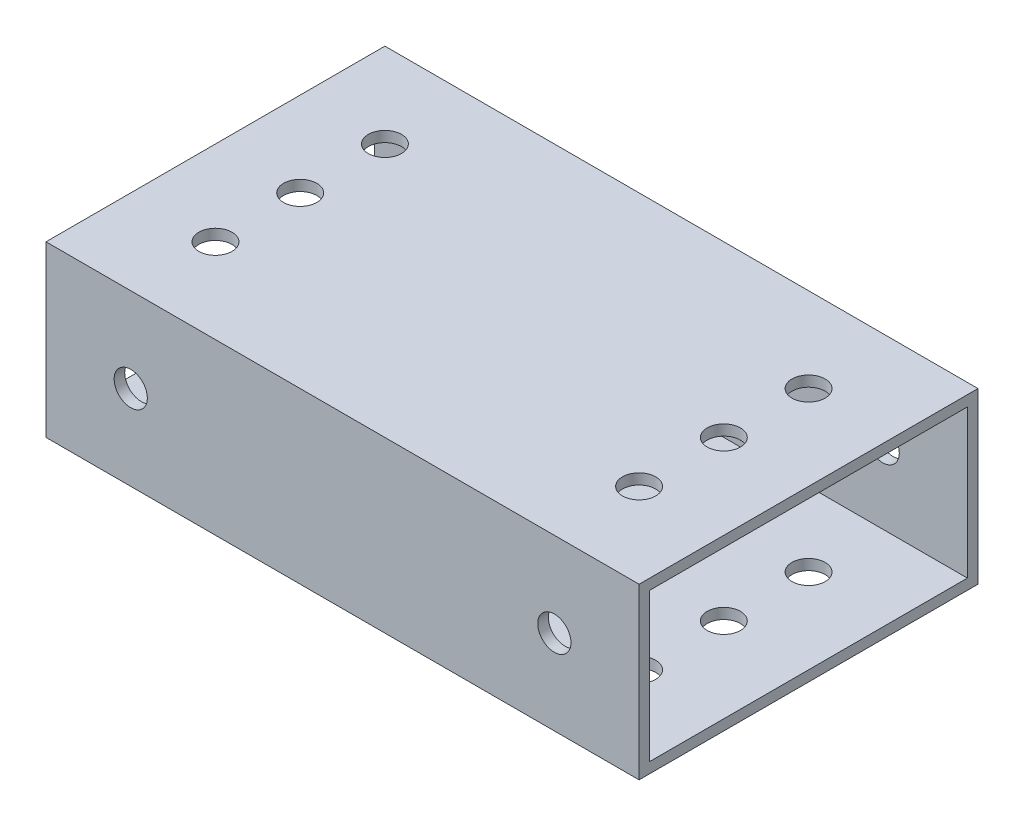
ISO-10303-21;
HEADER;
FILE_DESCRIPTION(('STEP AP214'),'2;1');
FILE_NAME('part.step','',(''),(''),'','','');
FILE_SCHEMA(('AUTOMOTIVE_DESIGN { 1 0 10303 214 1 1 1 1 }'));
ENDSEC;
DATA;
#1=APPLICATION_CONTEXT('core data for automotive mechanical design processes');
#2=APPLICATION_PROTOCOL_DEFINITION('international standard','automotive_design',2000,#1);
#3=PRODUCT_CONTEXT('',#1,'mechanical');
#4=PRODUCT('Part','Part','',(#3));
#5=PRODUCT_RELATED_PRODUCT_CATEGORY('part','',(#4));
#6=PRODUCT_DEFINITION_FORMATION('','',#4);
#7=PRODUCT_DEFINITION_CONTEXT('part definition',#1,'design');
#8=PRODUCT_DEFINITION('design','',#6,#7);
#9=PRODUCT_DEFINITION_SHAPE('','',#8);
#10=(LENGTH_UNIT() NAMED_UNIT(*) SI_UNIT(.MILLI.,.METRE.));
#11=(NAMED_UNIT(*) PLANE_ANGLE_UNIT() SI_UNIT($,.RADIAN.));
#12=(NAMED_UNIT(*) SI_UNIT($,.STERADIAN.) SOLID_ANGLE_UNIT());
#13=UNCERTAINTY_MEASURE_WITH_UNIT(LENGTH_MEASURE(1.E-05),#10,'distance_accuracy_value','');
#14=(GEOMETRIC_REPRESENTATION_CONTEXT(3) GLOBAL_UNCERTAINTY_ASSIGNED_CONTEXT((#13)) GLOBAL_UNIT_ASSIGNED_CONTEXT((#10,
#11,#12)) REPRESENTATION_CONTEXT('',''));
#15=CARTESIAN_POINT('',(0.,0.,0.));
#16=DIRECTION('',(0.,0.,1.));
#17=DIRECTION('',(1.,0.,0.));
#18=AXIS2_PLACEMENT_3D('',#15,#16,#17);
#19=CARTESIAN_POINT('',(44.45,0.,0.));
#20=DIRECTION('',(-1.,0.,0.));
#21=DIRECTION('',(0.,0.,1.));
#22=AXIS2_PLACEMENT_3D('',#19,#20,#21);
#23=PLANE('',#22);
#24=DIRECTION('',(0.,-1.,0.));
#25=VECTOR('',#24,1.);
#26=CARTESIAN_POINT('',(44.45,0.,0.));
#27=LINE('',#26,#25);
#28=CARTESIAN_POINT('',(44.45,25.4,0.));
#29=VERTEX_POINT('',#28);
#30=CARTESIAN_POINT('',(44.45,0.,0.));
#31=VERTEX_POINT('',#30);
#32=EDGE_CURVE('E135',#29,#31,#27,.T.);
#33=ORIENTED_EDGE('',*,*,#32,.T.);
#34=DIRECTION('',(0.,0.,-1.));
#35=VECTOR('',#34,1.);
#36=CARTESIAN_POINT('',(44.45,0.,0.));
#37=LINE('',#36,#35);
#38=CARTESIAN_POINT('',(44.45,0.,-50.8));
#39=VERTEX_POINT('',#38);
#40=EDGE_CURVE('E138',#31,#39,#37,.T.);
#41=ORIENTED_EDGE('',*,*,#40,.T.);
#42=DIRECTION('',(0.,1.,0.));
#43=VECTOR('',#42,1.);
#44=CARTESIAN_POINT('',(44.45,0.,-50.8));
#45=LINE('',#44,#43);
#46=CARTESIAN_POINT('',(44.45,25.4,-50.8));
#47=VERTEX_POINT('',#46);
#48=EDGE_CURVE('E141',#39,#47,#45,.T.);
#49=ORIENTED_EDGE('',*,*,#48,.T.);
#50=DIRECTION('',(0.,0.,1.));
#51=VECTOR('',#50,1.);
#52=CARTESIAN_POINT('',(44.45,25.4,0.));
#53=LINE('',#52,#51);
#54=EDGE_CURVE('E143',#47,#29,#53,.T.);
#55=ORIENTED_EDGE('',*,*,#54,.T.);
#56=EDGE_LOOP('',(#33,#41,#49,#55));
#57=FACE_BOUND('',#56,.T.);
#58=DIRECTION('',(0.,-1.,0.));
#59=VECTOR('',#58,1.);
#60=CARTESIAN_POINT('',(44.45,0.,-1.5875));
#61=LINE('',#60,#59);
#62=CARTESIAN_POINT('',(44.45,23.8125,-1.5875));
#63=VERTEX_POINT('',#62);
#64=CARTESIAN_POINT('',(44.45,1.5875,-1.5875));
#65=VERTEX_POINT('',#64);
#66=EDGE_CURVE('E123',#63,#65,#61,.T.);
#67=ORIENTED_EDGE('',*,*,#66,.F.);
#68=DIRECTION('',(0.,0.,1.));
#69=VECTOR('',#68,1.);
#70=CARTESIAN_POINT('',(44.45,23.8125,0.));
#71=LINE('',#70,#69);
#72=CARTESIAN_POINT('',(44.45,23.8125,-49.2125));
#73=VERTEX_POINT('',#72);
#74=EDGE_CURVE('E107',#73,#63,#71,.T.);
#75=ORIENTED_EDGE('',*,*,#74,.F.);
#76=DIRECTION('',(0.,1.,0.));
#77=VECTOR('',#76,1.);
#78=CARTESIAN_POINT('',(44.45,0.,-49.2125));
#79=LINE('',#78,#77);
#80=CARTESIAN_POINT('',(44.45,1.5875,-49.2125));
#81=VERTEX_POINT('',#80);
#82=EDGE_CURVE('E132',#81,#73,#79,.T.);
#83=ORIENTED_EDGE('',*,*,#82,.F.);
#84=DIRECTION('',(0.,0.,-1.));
#85=VECTOR('',#84,1.);
#86=CARTESIAN_POINT('',(44.45,1.5875,0.));
#87=LINE('',#86,#85);
#88=EDGE_CURVE('E125',#65,#81,#87,.T.);
#89=ORIENTED_EDGE('',*,*,#88,.F.);
#90=EDGE_LOOP('',(#67,#75,#83,#89));
#91=FACE_BOUND('',#90,.T.);
#92=ADVANCED_FACE('F35',(#57,#91),#23,.F.);
#93=CARTESIAN_POINT('',(-44.45,0.,0.));
#94=DIRECTION('',(-1.,0.,0.));
#95=DIRECTION('',(0.,0.,1.));
#96=AXIS2_PLACEMENT_3D('',#93,#94,#95);
#97=PLANE('',#96);
#98=DIRECTION('',(0.,-1.,0.));
#99=VECTOR('',#98,1.);
#100=CARTESIAN_POINT('',(-44.45,0.,0.));
#101=LINE('',#100,#99);
#102=CARTESIAN_POINT('',(-44.45,25.4,0.));
#103=VERTEX_POINT('',#102);
#104=CARTESIAN_POINT('',(-44.45,0.,0.));
#105=VERTEX_POINT('',#104);
#106=EDGE_CURVE('E146',#103,#105,#101,.T.);
#107=ORIENTED_EDGE('',*,*,#106,.F.);
#108=DIRECTION('',(0.,0.,1.));
#109=VECTOR('',#108,1.);
#110=CARTESIAN_POINT('',(-44.45,25.4,0.));
#111=LINE('',#110,#109);
#112=CARTESIAN_POINT('',(-44.45,25.4,-50.8));
#113=VERTEX_POINT('',#112);
#114=EDGE_CURVE('E139',#113,#103,#111,.T.);
#115=ORIENTED_EDGE('',*,*,#114,.F.);
#116=DIRECTION('',(0.,1.,0.));
#117=VECTOR('',#116,1.);
#118=CARTESIAN_POINT('',(-44.45,0.,-50.8));
#119=LINE('',#118,#117);
#120=CARTESIAN_POINT('',(-44.45,0.,-50.8));
#121=VERTEX_POINT('',#120);
#122=EDGE_CURVE('E151',#121,#113,#119,.T.);
#123=ORIENTED_EDGE('',*,*,#122,.F.);
#124=DIRECTION('',(0.,0.,-1.));
#125=VECTOR('',#124,1.);
#126=CARTESIAN_POINT('',(-44.45,0.,0.));
#127=LINE('',#126,#125);
#128=EDGE_CURVE('E149',#105,#121,#127,.T.);
#129=ORIENTED_EDGE('',*,*,#128,.F.);
#130=EDGE_LOOP('',(#107,#115,#123,#129));
#131=FACE_BOUND('',#130,.T.);
#132=DIRECTION('',(0.,0.,1.));
#133=VECTOR('',#132,1.);
#134=CARTESIAN_POINT('',(-44.45,23.8125,0.));
#135=LINE('',#134,#133);
#136=CARTESIAN_POINT('',(-44.45,23.8125,-49.2125));
#137=VERTEX_POINT('',#136);
#138=CARTESIAN_POINT('',(-44.45,23.8125,-1.5875));
#139=VERTEX_POINT('',#138);
#140=EDGE_CURVE('E105',#137,#139,#135,.T.);
#141=ORIENTED_EDGE('',*,*,#140,.T.);
#142=DIRECTION('',(0.,-1.,0.));
#143=VECTOR('',#142,1.);
#144=CARTESIAN_POINT('',(-44.45,0.,-1.5875));
#145=LINE('',#144,#143);
#146=CARTESIAN_POINT('',(-44.45,1.5875,-1.5875));
#147=VERTEX_POINT('',#146);
#148=EDGE_CURVE('E113',#139,#147,#145,.T.);
#149=ORIENTED_EDGE('',*,*,#148,.T.);
#150=DIRECTION('',(0.,0.,-1.));
#151=VECTOR('',#150,1.);
#152=CARTESIAN_POINT('',(-44.45,1.5875,0.));
#153=LINE('',#152,#151);
#154=CARTESIAN_POINT('',(-44.45,1.5875,-49.2125));
#155=VERTEX_POINT('',#154);
#156=EDGE_CURVE('E119',#147,#155,#153,.T.);
#157=ORIENTED_EDGE('',*,*,#156,.T.);
#158=DIRECTION('',(0.,1.,0.));
#159=VECTOR('',#158,1.);
#160=CARTESIAN_POINT('',(-44.45,0.,-49.2125));
#161=LINE('',#160,#159);
#162=EDGE_CURVE('E59',#155,#137,#161,.T.);
#163=ORIENTED_EDGE('',*,*,#162,.T.);
#164=EDGE_LOOP('',(#141,#149,#157,#163));
#165=FACE_BOUND('',#164,.T.);
#166=ADVANCED_FACE('F122',(#131,#165),#97,.T.);
#167=CARTESIAN_POINT('',(44.45,0.,0.));
#168=DIRECTION('',(0.,0.,-1.));
#169=DIRECTION('',(-1.,0.,0.));
#170=AXIS2_PLACEMENT_3D('',#167,#168,#169);
#171=PLANE('',#170);
#172=CARTESIAN_POINT('',(31.75,12.7,0.));
#173=DIRECTION('',(0.,0.,-1.));
#174=DIRECTION('',(-1.,0.,0.));
#175=AXIS2_PLACEMENT_3D('',#172,#173,#174);
#176=CIRCLE('',#175,2.4892);
#177=CARTESIAN_POINT('',(29.2608,12.7,0.));
#178=VERTEX_POINT('',#177);
#179=EDGE_CURVE('E374',#178,#178,#176,.T.);
#180=ORIENTED_EDGE('',*,*,#179,.T.);
#181=EDGE_LOOP('',(#180));
#182=FACE_BOUND('',#181,.T.);
#183=CARTESIAN_POINT('',(-31.75,12.7,0.));
#184=DIRECTION('',(0.,0.,1.));
#185=DIRECTION('',(1.,0.,0.));
#186=AXIS2_PLACEMENT_3D('',#183,#184,#185);
#187=CIRCLE('',#186,2.4892);
#188=CARTESIAN_POINT('',(-29.2608,12.7,0.));
#189=VERTEX_POINT('',#188);
#190=EDGE_CURVE('E192',#189,#189,#187,.T.);
#191=ORIENTED_EDGE('',*,*,#190,.F.);
#192=EDGE_LOOP('',(#191));
#193=FACE_BOUND('',#192,.T.);
#194=ORIENTED_EDGE('',*,*,#106,.T.);
#195=DIRECTION('',(-1.,0.,0.));
#196=VECTOR('',#195,1.);
#197=CARTESIAN_POINT('',(44.45,0.,0.));
#198=LINE('',#197,#196);
#199=EDGE_CURVE('E11',#31,#105,#198,.T.);
#200=ORIENTED_EDGE('',*,*,#199,.F.);
#201=ORIENTED_EDGE('',*,*,#32,.F.);
#202=DIRECTION('',(-1.,0.,0.));
#203=VECTOR('',#202,1.);
#204=CARTESIAN_POINT('',(44.45,25.4,0.));
#205=LINE('',#204,#203);
#206=EDGE_CURVE('E145',#29,#103,#205,.T.);
#207=ORIENTED_EDGE('',*,*,#206,.T.);
#208=EDGE_LOOP('',(#194,#200,#201,#207));
#209=FACE_BOUND('',#208,.T.);
#210=ADVANCED_FACE('F37',(#182,#193,#209),#171,.F.);
#211=CARTESIAN_POINT('',(44.45,0.,0.));
#212=DIRECTION('',(0.,1.,0.));
#213=DIRECTION('',(0.,0.,1.));
#214=AXIS2_PLACEMENT_3D('',#211,#212,#213);
#215=PLANE('',#214);
#216=CARTESIAN_POINT('',(31.75,0.,-38.1));
#217=DIRECTION('',(0.,-1.,0.));
#218=DIRECTION('',(0.,0.,1.));
#219=AXIS2_PLACEMENT_3D('',#216,#217,#218);
#220=CIRCLE('',#219,2.4892);
#221=CARTESIAN_POINT('',(31.75,0.,-35.6108));
#222=VERTEX_POINT('',#221);
#223=EDGE_CURVE('E276',#222,#222,#220,.T.);
#224=ORIENTED_EDGE('',*,*,#223,.F.);
#225=EDGE_LOOP('',(#224));
#226=FACE_BOUND('',#225,.T.);
#227=CARTESIAN_POINT('',(31.75,0.,-12.7));
#228=DIRECTION('',(0.,-1.,0.));
#229=DIRECTION('',(0.,0.,1.));
#230=AXIS2_PLACEMENT_3D('',#227,#228,#229);
#231=CIRCLE('',#230,2.4892);
#232=CARTESIAN_POINT('',(31.75,0.,-10.2108));
#233=VERTEX_POINT('',#232);
#234=EDGE_CURVE('E280',#233,#233,#231,.T.);
#235=ORIENTED_EDGE('',*,*,#234,.F.);
#236=EDGE_LOOP('',(#235));
#237=FACE_BOUND('',#236,.T.);
#238=CARTESIAN_POINT('',(31.75,0.,-25.4));
#239=DIRECTION('',(0.,-1.,0.));
#240=DIRECTION('',(0.,0.,1.));
#241=AXIS2_PLACEMENT_3D('',#238,#239,#240);
#242=CIRCLE('',#241,2.4892);
#243=CARTESIAN_POINT('',(31.75,0.,-22.9108));
#244=VERTEX_POINT('',#243);
#245=EDGE_CURVE('E182',#244,#244,#242,.T.);
#246=ORIENTED_EDGE('',*,*,#245,.F.);
#247=EDGE_LOOP('',(#246));
#248=FACE_BOUND('',#247,.T.);
#249=CARTESIAN_POINT('',(-31.75,0.,-38.1));
#250=DIRECTION('',(0.,1.,0.));
#251=DIRECTION('',(0.,0.,1.));
#252=AXIS2_PLACEMENT_3D('',#249,#250,#251);
#253=CIRCLE('',#252,2.4892);
#254=CARTESIAN_POINT('',(-31.75,0.,-35.6108));
#255=VERTEX_POINT('',#254);
#256=EDGE_CURVE('E215',#255,#255,#253,.T.);
#257=ORIENTED_EDGE('',*,*,#256,.T.);
#258=EDGE_LOOP('',(#257));
#259=FACE_BOUND('',#258,.T.);
#260=CARTESIAN_POINT('',(-31.75,0.,-12.7));
#261=DIRECTION('',(0.,1.,0.));
#262=DIRECTION('',(0.,0.,1.));
#263=AXIS2_PLACEMENT_3D('',#260,#261,#262);
#264=CIRCLE('',#263,2.4892);
#265=CARTESIAN_POINT('',(-31.75,0.,-10.2108));
#266=VERTEX_POINT('',#265);
#267=EDGE_CURVE('E208',#266,#266,#264,.T.);
#268=ORIENTED_EDGE('',*,*,#267,.T.);
#269=EDGE_LOOP('',(#268));
#270=FACE_BOUND('',#269,.T.);
#271=CARTESIAN_POINT('',(-31.75,0.,-25.4));
#272=DIRECTION('',(0.,1.,0.));
#273=DIRECTION('',(0.,0.,1.));
#274=AXIS2_PLACEMENT_3D('',#271,#272,#273);
#275=CIRCLE('',#274,2.4892);
#276=CARTESIAN_POINT('',(-31.75,0.,-22.9108));
#277=VERTEX_POINT('',#276);
#278=EDGE_CURVE('E165',#277,#277,#275,.T.);
#279=ORIENTED_EDGE('',*,*,#278,.T.);
#280=EDGE_LOOP('',(#279));
#281=FACE_BOUND('',#280,.T.);
#282=ORIENTED_EDGE('',*,*,#128,.T.);
#283=DIRECTION('',(-1.,0.,0.));
#284=VECTOR('',#283,1.);
#285=CARTESIAN_POINT('',(44.45,0.,-50.8));
#286=LINE('',#285,#284);
#287=EDGE_CURVE('E44',#39,#121,#286,.T.);
#288=ORIENTED_EDGE('',*,*,#287,.F.);
#289=ORIENTED_EDGE('',*,*,#40,.F.);
#290=ORIENTED_EDGE('',*,*,#199,.T.);
#291=EDGE_LOOP('',(#282,#288,#289,#290));
#292=FACE_BOUND('',#291,.T.);
#293=ADVANCED_FACE('F265',(#226,#237,#248,#259,#270,#281,#292),#215,.F.);
#294=CARTESIAN_POINT('',(44.45,0.,-50.8));
#295=DIRECTION('',(0.,0.,1.));
#296=DIRECTION('',(1.,0.,0.));
#297=AXIS2_PLACEMENT_3D('',#294,#295,#296);
#298=PLANE('',#297);
#299=CARTESIAN_POINT('',(31.75,12.7,-50.8));
#300=DIRECTION('',(0.,0.,-1.));
#301=DIRECTION('',(-1.,0.,0.));
#302=AXIS2_PLACEMENT_3D('',#299,#300,#301);
#303=CIRCLE('',#302,2.4892);
#304=CARTESIAN_POINT('',(29.2608,12.7,-50.8));
#305=VERTEX_POINT('',#304);
#306=EDGE_CURVE('E377',#305,#305,#303,.T.);
#307=ORIENTED_EDGE('',*,*,#306,.F.);
#308=EDGE_LOOP('',(#307));
#309=FACE_BOUND('',#308,.T.);
#310=CARTESIAN_POINT('',(-31.75,12.7,-50.8));
#311=DIRECTION('',(0.,0.,1.));
#312=DIRECTION('',(1.,0.,0.));
#313=AXIS2_PLACEMENT_3D('',#310,#311,#312);
#314=CIRCLE('',#313,2.4892);
#315=CARTESIAN_POINT('',(-29.2608,12.7,-50.8));
#316=VERTEX_POINT('',#315);
#317=EDGE_CURVE('E177',#316,#316,#314,.T.);
#318=ORIENTED_EDGE('',*,*,#317,.T.);
#319=EDGE_LOOP('',(#318));
#320=FACE_BOUND('',#319,.T.);
#321=ORIENTED_EDGE('',*,*,#122,.T.);
#322=DIRECTION('',(-1.,0.,0.));
#323=VECTOR('',#322,1.);
#324=CARTESIAN_POINT('',(44.45,25.4,-50.8));
#325=LINE('',#324,#323);
#326=EDGE_CURVE('E156',#47,#113,#325,.T.);
#327=ORIENTED_EDGE('',*,*,#326,.F.);
#328=ORIENTED_EDGE('',*,*,#48,.F.);
#329=ORIENTED_EDGE('',*,*,#287,.T.);
#330=EDGE_LOOP('',(#321,#327,#328,#329));
#331=FACE_BOUND('',#330,.T.);
#332=ADVANCED_FACE('F262',(#309,#320,#331),#298,.F.);
#333=CARTESIAN_POINT('',(44.45,25.4,0.));
#334=DIRECTION('',(0.,-1.,0.));
#335=DIRECTION('',(0.,0.,-1.));
#336=AXIS2_PLACEMENT_3D('',#333,#334,#335);
#337=PLANE('',#336);
#338=CARTESIAN_POINT('',(31.75,25.4,-38.1));
#339=DIRECTION('',(0.,-1.,0.));
#340=DIRECTION('',(0.,0.,1.));
#341=AXIS2_PLACEMENT_3D('',#338,#339,#340);
#342=CIRCLE('',#341,2.4892);
#343=CARTESIAN_POINT('',(31.75,25.4,-35.6108));
#344=VERTEX_POINT('',#343);
#345=EDGE_CURVE('E365',#344,#344,#342,.T.);
#346=ORIENTED_EDGE('',*,*,#345,.T.);
#347=EDGE_LOOP('',(#346));
#348=FACE_BOUND('',#347,.T.);
#349=CARTESIAN_POINT('',(31.75,25.4,-12.7));
#350=DIRECTION('',(0.,-1.,0.));
#351=DIRECTION('',(0.,0.,1.));
#352=AXIS2_PLACEMENT_3D('',#349,#350,#351);
#353=CIRCLE('',#352,2.4892);
#354=CARTESIAN_POINT('',(31.75,25.4,-10.2108));
#355=VERTEX_POINT('',#354);
#356=EDGE_CURVE('E362',#355,#355,#353,.T.);
#357=ORIENTED_EDGE('',*,*,#356,.T.);
#358=EDGE_LOOP('',(#357));
#359=FACE_BOUND('',#358,.T.);
#360=CARTESIAN_POINT('',(31.75,25.4,-25.4));
#361=DIRECTION('',(0.,-1.,0.));
#362=DIRECTION('',(0.,0.,1.));
#363=AXIS2_PLACEMENT_3D('',#360,#361,#362);
#364=CIRCLE('',#363,2.4892);
#365=CARTESIAN_POINT('',(31.75,25.4,-22.9108));
#366=VERTEX_POINT('',#365);
#367=EDGE_CURVE('E359',#366,#366,#364,.T.);
#368=ORIENTED_EDGE('',*,*,#367,.T.);
#369=EDGE_LOOP('',(#368));
#370=FACE_BOUND('',#369,.T.);
#371=CARTESIAN_POINT('',(-31.75,25.4,-38.1));
#372=DIRECTION('',(0.,1.,0.));
#373=DIRECTION('',(0.,0.,1.));
#374=AXIS2_PLACEMENT_3D('',#371,#372,#373);
#375=CIRCLE('',#374,2.4892);
#376=CARTESIAN_POINT('',(-31.75,25.4,-35.6108));
#377=VERTEX_POINT('',#376);
#378=EDGE_CURVE('E207',#377,#377,#375,.T.);
#379=ORIENTED_EDGE('',*,*,#378,.F.);
#380=EDGE_LOOP('',(#379));
#381=FACE_BOUND('',#380,.T.);
#382=CARTESIAN_POINT('',(-31.75,25.4,-12.7));
#383=DIRECTION('',(0.,1.,0.));
#384=DIRECTION('',(0.,0.,1.));
#385=AXIS2_PLACEMENT_3D('',#382,#383,#384);
#386=CIRCLE('',#385,2.4892);
#387=CARTESIAN_POINT('',(-31.75,25.4,-10.2108));
#388=VERTEX_POINT('',#387);
#389=EDGE_CURVE('E212',#388,#388,#386,.T.);
#390=ORIENTED_EDGE('',*,*,#389,.F.);
#391=EDGE_LOOP('',(#390));
#392=FACE_BOUND('',#391,.T.);
#393=CARTESIAN_POINT('',(-31.75,25.4,-25.4));
#394=DIRECTION('',(0.,1.,0.));
#395=DIRECTION('',(0.,0.,1.));
#396=AXIS2_PLACEMENT_3D('',#393,#394,#395);
#397=CIRCLE('',#396,2.4892);
#398=CARTESIAN_POINT('',(-31.75,25.4,-22.9108));
#399=VERTEX_POINT('',#398);
#400=EDGE_CURVE('E211',#399,#399,#397,.T.);
#401=ORIENTED_EDGE('',*,*,#400,.F.);
#402=EDGE_LOOP('',(#401));
#403=FACE_BOUND('',#402,.T.);
#404=ORIENTED_EDGE('',*,*,#114,.T.);
#405=ORIENTED_EDGE('',*,*,#206,.F.);
#406=ORIENTED_EDGE('',*,*,#54,.F.);
#407=ORIENTED_EDGE('',*,*,#326,.T.);
#408=EDGE_LOOP('',(#404,#405,#406,#407));
#409=FACE_BOUND('',#408,.T.);
#410=ADVANCED_FACE('F247',(#348,#359,#370,#381,#392,#403,#409),#337,.F.);
#411=CARTESIAN_POINT('',(44.45,0.,-1.5875));
#412=DIRECTION('',(0.,0.,-1.));
#413=DIRECTION('',(-1.,0.,0.));
#414=AXIS2_PLACEMENT_3D('',#411,#412,#413);
#415=PLANE('',#414);
#416=CARTESIAN_POINT('',(31.75,12.7,-1.5875));
#417=DIRECTION('',(0.,0.,-1.));
#418=DIRECTION('',(-1.,0.,0.));
#419=AXIS2_PLACEMENT_3D('',#416,#417,#418);
#420=CIRCLE('',#419,2.4892);
#421=CARTESIAN_POINT('',(29.2608,12.7,-1.5875));
#422=VERTEX_POINT('',#421);
#423=EDGE_CURVE('E368',#422,#422,#420,.F.);
#424=ORIENTED_EDGE('',*,*,#423,.T.);
#425=EDGE_LOOP('',(#424));
#426=FACE_BOUND('',#425,.T.);
#427=CARTESIAN_POINT('',(-31.75,12.7,-1.5875));
#428=DIRECTION('',(0.,0.,-1.));
#429=DIRECTION('',(-1.,0.,0.));
#430=AXIS2_PLACEMENT_3D('',#427,#428,#429);
#431=CIRCLE('',#430,2.4892);
#432=CARTESIAN_POINT('',(-34.2392,12.7,-1.5875));
#433=VERTEX_POINT('',#432);
#434=EDGE_CURVE('E176',#433,#433,#431,.T.);
#435=ORIENTED_EDGE('',*,*,#434,.F.);
#436=EDGE_LOOP('',(#435));
#437=FACE_BOUND('',#436,.T.);
#438=ORIENTED_EDGE('',*,*,#148,.F.);
#439=DIRECTION('',(-1.,0.,0.));
#440=VECTOR('',#439,1.);
#441=CARTESIAN_POINT('',(44.45,23.8125,-1.5875));
#442=LINE('',#441,#440);
#443=EDGE_CURVE('E101',#63,#139,#442,.T.);
#444=ORIENTED_EDGE('',*,*,#443,.F.);
#445=ORIENTED_EDGE('',*,*,#66,.T.);
#446=DIRECTION('',(-1.,0.,0.));
#447=VECTOR('',#446,1.);
#448=CARTESIAN_POINT('',(44.45,1.5875,-1.5875));
#449=LINE('',#448,#447);
#450=EDGE_CURVE('E116',#65,#147,#449,.T.);
#451=ORIENTED_EDGE('',*,*,#450,.T.);
#452=EDGE_LOOP('',(#438,#444,#445,#451));
#453=FACE_BOUND('',#452,.T.);
#454=ADVANCED_FACE('F114',(#426,#437,#453),#415,.T.);
#455=CARTESIAN_POINT('',(44.45,1.5875,0.));
#456=DIRECTION('',(0.,1.,0.));
#457=DIRECTION('',(0.,0.,1.));
#458=AXIS2_PLACEMENT_3D('',#455,#456,#457);
#459=PLANE('',#458);
#460=CARTESIAN_POINT('',(31.75,1.5875,-38.1));
#461=DIRECTION('',(0.,1.,0.));
#462=DIRECTION('',(0.,0.,1.));
#463=AXIS2_PLACEMENT_3D('',#460,#461,#462);
#464=CIRCLE('',#463,2.4892);
#465=CARTESIAN_POINT('',(31.75,1.5875,-35.6108));
#466=VERTEX_POINT('',#465);
#467=EDGE_CURVE('E188',#466,#466,#464,.F.);
#468=ORIENTED_EDGE('',*,*,#467,.T.);
#469=EDGE_LOOP('',(#468));
#470=FACE_BOUND('',#469,.T.);
#471=CARTESIAN_POINT('',(31.75,1.5875,-12.7));
#472=DIRECTION('',(0.,1.,0.));
#473=DIRECTION('',(0.,0.,1.));
#474=AXIS2_PLACEMENT_3D('',#471,#472,#473);
#475=CIRCLE('',#474,2.4892);
#476=CARTESIAN_POINT('',(31.75,1.5875,-10.2108));
#477=VERTEX_POINT('',#476);
#478=EDGE_CURVE('E185',#477,#477,#475,.F.);
#479=ORIENTED_EDGE('',*,*,#478,.T.);
#480=EDGE_LOOP('',(#479));
#481=FACE_BOUND('',#480,.T.);
#482=CARTESIAN_POINT('',(31.75,1.5875,-25.4));
#483=DIRECTION('',(0.,1.,0.));
#484=DIRECTION('',(0.,0.,1.));
#485=AXIS2_PLACEMENT_3D('',#482,#483,#484);
#486=CIRCLE('',#485,2.4892);
#487=CARTESIAN_POINT('',(31.75,1.5875,-22.9108));
#488=VERTEX_POINT('',#487);
#489=EDGE_CURVE('E181',#488,#488,#486,.F.);
#490=ORIENTED_EDGE('',*,*,#489,.T.);
#491=EDGE_LOOP('',(#490));
#492=FACE_BOUND('',#491,.T.);
#493=CARTESIAN_POINT('',(-31.75,1.5875,-38.1));
#494=DIRECTION('',(0.,1.,0.));
#495=DIRECTION('',(0.,0.,1.));
#496=AXIS2_PLACEMENT_3D('',#493,#494,#495);
#497=CIRCLE('',#496,2.4892);
#498=CARTESIAN_POINT('',(-31.75,1.5875,-35.6108));
#499=VERTEX_POINT('',#498);
#500=EDGE_CURVE('E120',#499,#499,#497,.T.);
#501=ORIENTED_EDGE('',*,*,#500,.F.);
#502=EDGE_LOOP('',(#501));
#503=FACE_BOUND('',#502,.T.);
#504=CARTESIAN_POINT('',(-31.75,1.5875,-12.7));
#505=DIRECTION('',(0.,1.,0.));
#506=DIRECTION('',(0.,0.,1.));
#507=AXIS2_PLACEMENT_3D('',#504,#505,#506);
#508=CIRCLE('',#507,2.4892);
#509=CARTESIAN_POINT('',(-31.75,1.5875,-10.2108));
#510=VERTEX_POINT('',#509);
#511=EDGE_CURVE('E169',#510,#510,#508,.T.);
#512=ORIENTED_EDGE('',*,*,#511,.F.);
#513=EDGE_LOOP('',(#512));
#514=FACE_BOUND('',#513,.T.);
#515=CARTESIAN_POINT('',(-31.75,1.5875,-25.4));
#516=DIRECTION('',(0.,1.,0.));
#517=DIRECTION('',(0.,0.,1.));
#518=AXIS2_PLACEMENT_3D('',#515,#516,#517);
#519=CIRCLE('',#518,2.4892);
#520=CARTESIAN_POINT('',(-31.75,1.5875,-22.9108));
#521=VERTEX_POINT('',#520);
#522=EDGE_CURVE('E164',#521,#521,#519,.T.);
#523=ORIENTED_EDGE('',*,*,#522,.F.);
#524=EDGE_LOOP('',(#523));
#525=FACE_BOUND('',#524,.T.);
#526=ORIENTED_EDGE('',*,*,#156,.F.);
#527=ORIENTED_EDGE('',*,*,#450,.F.);
#528=ORIENTED_EDGE('',*,*,#88,.T.);
#529=DIRECTION('',(-1.,0.,0.));
#530=VECTOR('',#529,1.);
#531=CARTESIAN_POINT('',(44.45,1.5875,-49.2125));
#532=LINE('',#531,#530);
#533=EDGE_CURVE('E230',#81,#155,#532,.T.);
#534=ORIENTED_EDGE('',*,*,#533,.T.);
#535=EDGE_LOOP('',(#526,#527,#528,#534));
#536=FACE_BOUND('',#535,.T.);
#537=ADVANCED_FACE('F237',(#470,#481,#492,#503,#514,#525,#536),#459,.T.);
#538=CARTESIAN_POINT('',(44.45,0.,-49.2125));
#539=DIRECTION('',(0.,0.,1.));
#540=DIRECTION('',(1.,0.,0.));
#541=AXIS2_PLACEMENT_3D('',#538,#539,#540);
#542=PLANE('',#541);
#543=CARTESIAN_POINT('',(31.75,12.7,-49.2125));
#544=DIRECTION('',(0.,0.,1.));
#545=DIRECTION('',(1.,0.,0.));
#546=AXIS2_PLACEMENT_3D('',#543,#544,#545);
#547=CIRCLE('',#546,2.4892);
#548=CARTESIAN_POINT('',(34.2392,12.7,-49.2125));
#549=VERTEX_POINT('',#548);
#550=EDGE_CURVE('E39',#549,#549,#547,.F.);
#551=ORIENTED_EDGE('',*,*,#550,.T.);
#552=EDGE_LOOP('',(#551));
#553=FACE_BOUND('',#552,.T.);
#554=CARTESIAN_POINT('',(-31.75,12.7,-49.2125));
#555=DIRECTION('',(0.,0.,1.));
#556=DIRECTION('',(1.,0.,0.));
#557=AXIS2_PLACEMENT_3D('',#554,#555,#556);
#558=CIRCLE('',#557,2.4892);
#559=CARTESIAN_POINT('',(-29.2608,12.7,-49.2125));
#560=VERTEX_POINT('',#559);
#561=EDGE_CURVE('E173',#560,#560,#558,.T.);
#562=ORIENTED_EDGE('',*,*,#561,.F.);
#563=EDGE_LOOP('',(#562));
#564=FACE_BOUND('',#563,.T.);
#565=ORIENTED_EDGE('',*,*,#162,.F.);
#566=ORIENTED_EDGE('',*,*,#533,.F.);
#567=ORIENTED_EDGE('',*,*,#82,.T.);
#568=DIRECTION('',(-1.,0.,0.));
#569=VECTOR('',#568,1.);
#570=CARTESIAN_POINT('',(44.45,23.8125,-49.2125));
#571=LINE('',#570,#569);
#572=EDGE_CURVE('E52',#73,#137,#571,.T.);
#573=ORIENTED_EDGE('',*,*,#572,.T.);
#574=EDGE_LOOP('',(#565,#566,#567,#573));
#575=FACE_BOUND('',#574,.T.);
#576=ADVANCED_FACE('F232',(#553,#564,#575),#542,.T.);
#577=CARTESIAN_POINT('',(44.45,23.8125,0.));
#578=DIRECTION('',(0.,-1.,0.));
#579=DIRECTION('',(0.,0.,-1.));
#580=AXIS2_PLACEMENT_3D('',#577,#578,#579);
#581=PLANE('',#580);
#582=CARTESIAN_POINT('',(31.75,23.8125,-38.1));
#583=DIRECTION('',(0.,-1.,0.));
#584=DIRECTION('',(0.,0.,-1.));
#585=AXIS2_PLACEMENT_3D('',#582,#583,#584);
#586=CIRCLE('',#585,2.4892);
#587=CARTESIAN_POINT('',(31.75,23.8125,-40.5892));
#588=VERTEX_POINT('',#587);
#589=EDGE_CURVE('E186',#588,#588,#586,.F.);
#590=ORIENTED_EDGE('',*,*,#589,.T.);
#591=EDGE_LOOP('',(#590));
#592=FACE_BOUND('',#591,.T.);
#593=CARTESIAN_POINT('',(31.75,23.8125,-12.7));
#594=DIRECTION('',(0.,-1.,0.));
#595=DIRECTION('',(0.,0.,-1.));
#596=AXIS2_PLACEMENT_3D('',#593,#594,#595);
#597=CIRCLE('',#596,2.4892);
#598=CARTESIAN_POINT('',(31.75,23.8125,-15.1892));
#599=VERTEX_POINT('',#598);
#600=EDGE_CURVE('E183',#599,#599,#597,.F.);
#601=ORIENTED_EDGE('',*,*,#600,.T.);
#602=EDGE_LOOP('',(#601));
#603=FACE_BOUND('',#602,.T.);
#604=CARTESIAN_POINT('',(31.75,23.8125,-25.4));
#605=DIRECTION('',(0.,-1.,0.));
#606=DIRECTION('',(0.,0.,-1.));
#607=AXIS2_PLACEMENT_3D('',#604,#605,#606);
#608=CIRCLE('',#607,2.4892);
#609=CARTESIAN_POINT('',(31.75,23.8125,-27.8892));
#610=VERTEX_POINT('',#609);
#611=EDGE_CURVE('E178',#610,#610,#608,.F.);
#612=ORIENTED_EDGE('',*,*,#611,.T.);
#613=EDGE_LOOP('',(#612));
#614=FACE_BOUND('',#613,.T.);
#615=CARTESIAN_POINT('',(-31.75,23.8125,-38.1));
#616=DIRECTION('',(0.,-1.,0.));
#617=DIRECTION('',(0.,0.,-1.));
#618=AXIS2_PLACEMENT_3D('',#615,#616,#617);
#619=CIRCLE('',#618,2.4892);
#620=CARTESIAN_POINT('',(-31.75,23.8125,-40.5892));
#621=VERTEX_POINT('',#620);
#622=EDGE_CURVE('E170',#621,#621,#619,.T.);
#623=ORIENTED_EDGE('',*,*,#622,.F.);
#624=EDGE_LOOP('',(#623));
#625=FACE_BOUND('',#624,.T.);
#626=CARTESIAN_POINT('',(-31.75,23.8125,-12.7));
#627=DIRECTION('',(0.,-1.,0.));
#628=DIRECTION('',(0.,0.,-1.));
#629=AXIS2_PLACEMENT_3D('',#626,#627,#628);
#630=CIRCLE('',#629,2.4892);
#631=CARTESIAN_POINT('',(-31.75,23.8125,-15.1892));
#632=VERTEX_POINT('',#631);
#633=EDGE_CURVE('E166',#632,#632,#630,.T.);
#634=ORIENTED_EDGE('',*,*,#633,.F.);
#635=EDGE_LOOP('',(#634));
#636=FACE_BOUND('',#635,.T.);
#637=CARTESIAN_POINT('',(-31.75,23.8125,-25.4));
#638=DIRECTION('',(0.,-1.,0.));
#639=DIRECTION('',(0.,0.,-1.));
#640=AXIS2_PLACEMENT_3D('',#637,#638,#639);
#641=CIRCLE('',#640,2.4892);
#642=CARTESIAN_POINT('',(-31.75,23.8125,-27.8892));
#643=VERTEX_POINT('',#642);
#644=EDGE_CURVE('E161',#643,#643,#641,.T.);
#645=ORIENTED_EDGE('',*,*,#644,.F.);
#646=EDGE_LOOP('',(#645));
#647=FACE_BOUND('',#646,.T.);
#648=ORIENTED_EDGE('',*,*,#140,.F.);
#649=ORIENTED_EDGE('',*,*,#572,.F.);
#650=ORIENTED_EDGE('',*,*,#74,.T.);
#651=ORIENTED_EDGE('',*,*,#443,.T.);
#652=EDGE_LOOP('',(#648,#649,#650,#651));
#653=FACE_BOUND('',#652,.T.);
#654=ADVANCED_FACE('F103',(#592,#603,#614,#625,#636,#647,#653),#581,.T.);
#655=CARTESIAN_POINT('',(-31.75,0.,-25.4));
#656=DIRECTION('',(0.,1.,0.));
#657=DIRECTION('',(0.,0.,1.));
#658=AXIS2_PLACEMENT_3D('',#655,#656,#657);
#659=CYLINDRICAL_SURFACE('',#658,2.4892);
#660=ORIENTED_EDGE('',*,*,#644,.T.);
#661=EDGE_LOOP('',(#660));
#662=FACE_BOUND('',#661,.T.);
#663=ORIENTED_EDGE('',*,*,#400,.T.);
#664=EDGE_LOOP('',(#663));
#665=FACE_BOUND('',#664,.T.);
#666=ADVANCED_FACE('F310',(#662,#665),#659,.F.);
#667=CARTESIAN_POINT('',(-31.75,0.,-12.7));
#668=DIRECTION('',(0.,1.,0.));
#669=DIRECTION('',(0.,0.,1.));
#670=AXIS2_PLACEMENT_3D('',#667,#668,#669);
#671=CYLINDRICAL_SURFACE('',#670,2.4892);
#672=ORIENTED_EDGE('',*,*,#633,.T.);
#673=EDGE_LOOP('',(#672));
#674=FACE_BOUND('',#673,.T.);
#675=ORIENTED_EDGE('',*,*,#389,.T.);
#676=EDGE_LOOP('',(#675));
#677=FACE_BOUND('',#676,.T.);
#678=ADVANCED_FACE('F318',(#674,#677),#671,.F.);
#679=CARTESIAN_POINT('',(-31.75,0.,-38.1));
#680=DIRECTION('',(0.,1.,0.));
#681=DIRECTION('',(0.,0.,1.));
#682=AXIS2_PLACEMENT_3D('',#679,#680,#681);
#683=CYLINDRICAL_SURFACE('',#682,2.4892);
#684=ORIENTED_EDGE('',*,*,#622,.T.);
#685=EDGE_LOOP('',(#684));
#686=FACE_BOUND('',#685,.T.);
#687=ORIENTED_EDGE('',*,*,#378,.T.);
#688=EDGE_LOOP('',(#687));
#689=FACE_BOUND('',#688,.T.);
#690=ADVANCED_FACE('F307',(#686,#689),#683,.F.);
#691=ORIENTED_EDGE('',*,*,#522,.T.);
#692=EDGE_LOOP('',(#691));
#693=FACE_BOUND('',#692,.T.);
#694=ORIENTED_EDGE('',*,*,#278,.F.);
#695=EDGE_LOOP('',(#694));
#696=FACE_BOUND('',#695,.T.);
#697=ADVANCED_FACE('F304',(#693,#696),#659,.F.);
#698=ORIENTED_EDGE('',*,*,#511,.T.);
#699=EDGE_LOOP('',(#698));
#700=FACE_BOUND('',#699,.T.);
#701=ORIENTED_EDGE('',*,*,#267,.F.);
#702=EDGE_LOOP('',(#701));
#703=FACE_BOUND('',#702,.T.);
#704=ADVANCED_FACE('F306',(#700,#703),#671,.F.);
#705=ORIENTED_EDGE('',*,*,#500,.T.);
#706=EDGE_LOOP('',(#705));
#707=FACE_BOUND('',#706,.T.);
#708=ORIENTED_EDGE('',*,*,#256,.F.);
#709=EDGE_LOOP('',(#708));
#710=FACE_BOUND('',#709,.T.);
#711=ADVANCED_FACE('F315',(#707,#710),#683,.F.);
#712=CARTESIAN_POINT('',(-31.75,12.7,-50.8));
#713=DIRECTION('',(0.,0.,1.));
#714=DIRECTION('',(1.,0.,0.));
#715=AXIS2_PLACEMENT_3D('',#712,#713,#714);
#716=CYLINDRICAL_SURFACE('',#715,2.4892);
#717=ORIENTED_EDGE('',*,*,#561,.T.);
#718=EDGE_LOOP('',(#717));
#719=FACE_BOUND('',#718,.T.);
#720=ORIENTED_EDGE('',*,*,#317,.F.);
#721=EDGE_LOOP('',(#720));
#722=FACE_BOUND('',#721,.T.);
#723=ADVANCED_FACE('F405',(#719,#722),#716,.F.);
#724=ORIENTED_EDGE('',*,*,#434,.T.);
#725=EDGE_LOOP('',(#724));
#726=FACE_BOUND('',#725,.T.);
#727=ORIENTED_EDGE('',*,*,#190,.T.);
#728=EDGE_LOOP('',(#727));
#729=FACE_BOUND('',#728,.T.);
#730=ADVANCED_FACE('F354',(#726,#729),#716,.F.);
#731=CARTESIAN_POINT('',(31.75,0.,-25.4));
#732=DIRECTION('',(0.,1.,0.));
#733=DIRECTION('',(0.,0.,1.));
#734=AXIS2_PLACEMENT_3D('',#731,#732,#733);
#735=CYLINDRICAL_SURFACE('',#734,2.4892);
#736=ORIENTED_EDGE('',*,*,#611,.F.);
#737=EDGE_LOOP('',(#736));
#738=FACE_BOUND('',#737,.T.);
#739=ORIENTED_EDGE('',*,*,#367,.F.);
#740=EDGE_LOOP('',(#739));
#741=FACE_BOUND('',#740,.T.);
#742=ADVANCED_FACE('F350',(#738,#741),#735,.F.);
#743=CARTESIAN_POINT('',(31.75,0.,-12.7));
#744=DIRECTION('',(0.,1.,0.));
#745=DIRECTION('',(0.,0.,1.));
#746=AXIS2_PLACEMENT_3D('',#743,#744,#745);
#747=CYLINDRICAL_SURFACE('',#746,2.4892);
#748=ORIENTED_EDGE('',*,*,#600,.F.);
#749=EDGE_LOOP('',(#748));
#750=FACE_BOUND('',#749,.T.);
#751=ORIENTED_EDGE('',*,*,#356,.F.);
#752=EDGE_LOOP('',(#751));
#753=FACE_BOUND('',#752,.T.);
#754=ADVANCED_FACE('F353',(#750,#753),#747,.F.);
#755=CARTESIAN_POINT('',(31.75,0.,-38.1));
#756=DIRECTION('',(0.,1.,0.));
#757=DIRECTION('',(0.,0.,1.));
#758=AXIS2_PLACEMENT_3D('',#755,#756,#757);
#759=CYLINDRICAL_SURFACE('',#758,2.4892);
#760=ORIENTED_EDGE('',*,*,#589,.F.);
#761=EDGE_LOOP('',(#760));
#762=FACE_BOUND('',#761,.T.);
#763=ORIENTED_EDGE('',*,*,#345,.F.);
#764=EDGE_LOOP('',(#763));
#765=FACE_BOUND('',#764,.T.);
#766=ADVANCED_FACE('F398',(#762,#765),#759,.F.);
#767=ORIENTED_EDGE('',*,*,#489,.F.);
#768=EDGE_LOOP('',(#767));
#769=FACE_BOUND('',#768,.T.);
#770=ORIENTED_EDGE('',*,*,#245,.T.);
#771=EDGE_LOOP('',(#770));
#772=FACE_BOUND('',#771,.T.);
#773=ADVANCED_FACE('F356',(#769,#772),#735,.F.);
#774=ORIENTED_EDGE('',*,*,#478,.F.);
#775=EDGE_LOOP('',(#774));
#776=FACE_BOUND('',#775,.T.);
#777=ORIENTED_EDGE('',*,*,#234,.T.);
#778=EDGE_LOOP('',(#777));
#779=FACE_BOUND('',#778,.T.);
#780=ADVANCED_FACE('F395',(#776,#779),#747,.F.);
#781=ORIENTED_EDGE('',*,*,#467,.F.);
#782=EDGE_LOOP('',(#781));
#783=FACE_BOUND('',#782,.T.);
#784=ORIENTED_EDGE('',*,*,#223,.T.);
#785=EDGE_LOOP('',(#784));
#786=FACE_BOUND('',#785,.T.);
#787=ADVANCED_FACE('F388',(#783,#786),#759,.F.);
#788=CARTESIAN_POINT('',(31.75,12.7,-50.8));
#789=DIRECTION('',(0.,0.,1.));
#790=DIRECTION('',(1.,0.,0.));
#791=AXIS2_PLACEMENT_3D('',#788,#789,#790);
#792=CYLINDRICAL_SURFACE('',#791,2.4892);
#793=ORIENTED_EDGE('',*,*,#550,.F.);
#794=EDGE_LOOP('',(#793));
#795=FACE_BOUND('',#794,.T.);
#796=ORIENTED_EDGE('',*,*,#306,.T.);
#797=EDGE_LOOP('',(#796));
#798=FACE_BOUND('',#797,.T.);
#799=ADVANCED_FACE('F385',(#795,#798),#792,.F.);
#800=ORIENTED_EDGE('',*,*,#423,.F.);
#801=EDGE_LOOP('',(#800));
#802=FACE_BOUND('',#801,.T.);
#803=ORIENTED_EDGE('',*,*,#179,.F.);
#804=EDGE_LOOP('',(#803));
#805=FACE_BOUND('',#804,.T.);
#806=ADVANCED_FACE('F387',(#802,#805),#792,.F.);
#807=CLOSED_SHELL('',(#92,#166,#210,#293,#332,#410,#454,#537,#576,#654,#666,#678,#690,#697,#704,
#711,#723,#730,#742,#754,#766,#773,#780,#787,#799,#806));
#808=MANIFOLD_SOLID_BREP('B2',#807);
#809=ADVANCED_BREP_SHAPE_REPRESENTATION('',(#18,#808),#14);
#810=SHAPE_DEFINITION_REPRESENTATION(#9,#809);
ENDSEC;
END-ISO-10303-21;
